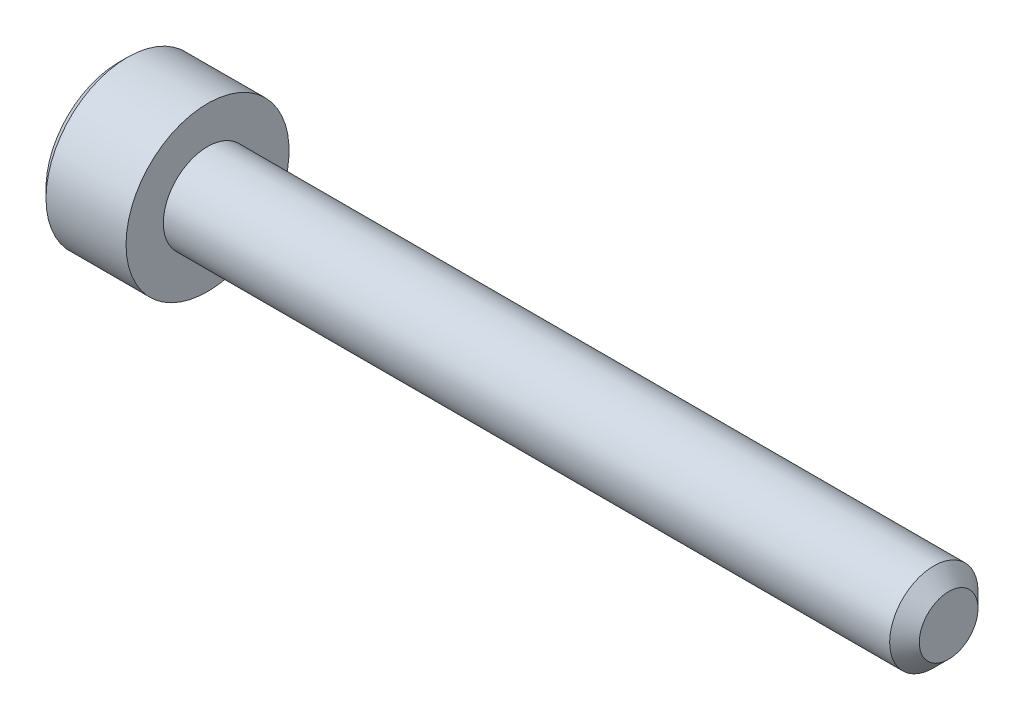
ISO-10303-21;
HEADER;
FILE_DESCRIPTION(('STEP AP214'),'2;1');
FILE_NAME('part.step','',(''),(''),'','','');
FILE_SCHEMA(('AUTOMOTIVE_DESIGN { 1 0 10303 214 1 1 1 1 }'));
ENDSEC;
DATA;
#1=APPLICATION_CONTEXT('core data for automotive mechanical design processes');
#2=APPLICATION_PROTOCOL_DEFINITION('international standard','automotive_design',2000,#1);
#3=PRODUCT_CONTEXT('',#1,'mechanical');
#4=PRODUCT('Part','Part','',(#3));
#5=PRODUCT_RELATED_PRODUCT_CATEGORY('part','',(#4));
#6=PRODUCT_DEFINITION_FORMATION('','',#4);
#7=PRODUCT_DEFINITION_CONTEXT('part definition',#1,'design');
#8=PRODUCT_DEFINITION('design','',#6,#7);
#9=PRODUCT_DEFINITION_SHAPE('','',#8);
#10=(LENGTH_UNIT() NAMED_UNIT(*) SI_UNIT(.MILLI.,.METRE.));
#11=(NAMED_UNIT(*) PLANE_ANGLE_UNIT() SI_UNIT($,.RADIAN.));
#12=(NAMED_UNIT(*) SI_UNIT($,.STERADIAN.) SOLID_ANGLE_UNIT());
#13=UNCERTAINTY_MEASURE_WITH_UNIT(LENGTH_MEASURE(1.E-05),#10,'distance_accuracy_value','');
#14=(GEOMETRIC_REPRESENTATION_CONTEXT(3) GLOBAL_UNCERTAINTY_ASSIGNED_CONTEXT((#13)) GLOBAL_UNIT_ASSIGNED_CONTEXT((#10,
#11,#12)) REPRESENTATION_CONTEXT('',''));
#15=CARTESIAN_POINT('',(0.,0.,0.));
#16=DIRECTION('',(0.,0.,1.));
#17=DIRECTION('',(1.,0.,0.));
#18=AXIS2_PLACEMENT_3D('',#15,#16,#17);
#19=CARTESIAN_POINT('',(0.,0.,0.));
#20=DIRECTION('',(1.,0.,0.));
#21=DIRECTION('',(0.,0.,-1.));
#22=AXIS2_PLACEMENT_3D('',#19,#20,#21);
#23=PLANE('',#22);
#24=DIRECTION('',(0.,0.866025403784439,0.5));
#25=VECTOR('',#24,1.);
#26=CARTESIAN_POINT('',(0.,1.4,-0.981495457622365));
#27=LINE('',#26,#25);
#28=CARTESIAN_POINT('',(0.,0.,-1.78978583448784));
#29=VERTEX_POINT('',#28);
#30=CARTESIAN_POINT('',(0.,1.55,-0.89489291724392));
#31=VERTEX_POINT('',#30);
#32=EDGE_CURVE('E171',#29,#31,#27,.T.);
#33=ORIENTED_EDGE('',*,*,#32,.T.);
#34=DIRECTION('',(0.,0.,1.));
#35=VECTOR('',#34,1.);
#36=CARTESIAN_POINT('',(0.,1.55,0.721687836487032));
#37=LINE('',#36,#35);
#38=CARTESIAN_POINT('',(0.,1.55,0.894892917243921));
#39=VERTEX_POINT('',#38);
#40=EDGE_CURVE('E186',#31,#39,#37,.T.);
#41=ORIENTED_EDGE('',*,*,#40,.T.);
#42=DIRECTION('',(0.,-0.866025403784439,0.5));
#43=VECTOR('',#42,1.);
#44=CARTESIAN_POINT('',(0.,0.150000000000001,1.7031832941094));
#45=LINE('',#44,#43);
#46=CARTESIAN_POINT('',(0.,0.,1.78978583448784));
#47=VERTEX_POINT('',#46);
#48=EDGE_CURVE('E183',#39,#47,#45,.T.);
#49=ORIENTED_EDGE('',*,*,#48,.T.);
#50=DIRECTION('',(0.,-0.866025403784439,-0.5));
#51=VECTOR('',#50,1.);
#52=CARTESIAN_POINT('',(0.,-1.4,0.981495457622367));
#53=LINE('',#52,#51);
#54=CARTESIAN_POINT('',(0.,-1.55,0.894892917243922));
#55=VERTEX_POINT('',#54);
#56=EDGE_CURVE('E180',#47,#55,#53,.T.);
#57=ORIENTED_EDGE('',*,*,#56,.T.);
#58=DIRECTION('',(0.,0.,-1.));
#59=VECTOR('',#58,1.);
#60=CARTESIAN_POINT('',(0.,-1.55,-0.721687836487031));
#61=LINE('',#60,#59);
#62=CARTESIAN_POINT('',(0.,-1.55,-0.894892917243921));
#63=VERTEX_POINT('',#62);
#64=EDGE_CURVE('E177',#55,#63,#61,.T.);
#65=ORIENTED_EDGE('',*,*,#64,.T.);
#66=DIRECTION('',(0.,0.866025403784439,-0.5));
#67=VECTOR('',#66,1.);
#68=CARTESIAN_POINT('',(0.,-0.150000000000001,-1.7031832941094));
#69=LINE('',#68,#67);
#70=EDGE_CURVE('E174',#63,#29,#69,.T.);
#71=ORIENTED_EDGE('',*,*,#70,.T.);
#72=EDGE_LOOP('',(#33,#41,#49,#57,#65,#71));
#73=FACE_BOUND('',#72,.T.);
#74=CARTESIAN_POINT('',(0.,0.,0.));
#75=DIRECTION('',(1.,0.,0.));
#76=DIRECTION('',(0.,0.,-1.));
#77=AXIS2_PLACEMENT_3D('',#74,#75,#76);
#78=CIRCLE('',#77,2.45);
#79=CARTESIAN_POINT('',(0.,0.,-2.45));
#80=VERTEX_POINT('',#79);
#81=EDGE_CURVE('E163',#80,#80,#78,.F.);
#82=ORIENTED_EDGE('',*,*,#81,.T.);
#83=EDGE_LOOP('',(#82));
#84=FACE_BOUND('',#83,.T.);
#85=ADVANCED_FACE('F39',(#73,#84),#23,.F.);
#86=CARTESIAN_POINT('',(28.,0.,0.));
#87=DIRECTION('',(-1.,0.,0.));
#88=DIRECTION('',(0.,0.,1.));
#89=AXIS2_PLACEMENT_3D('',#86,#87,#88);
#90=PLANE('',#89);
#91=CARTESIAN_POINT('',(28.,0.,0.));
#92=DIRECTION('',(-1.,0.,0.));
#93=DIRECTION('',(0.,0.,1.));
#94=AXIS2_PLACEMENT_3D('',#91,#92,#93);
#95=CIRCLE('',#94,0.989999999999994);
#96=CARTESIAN_POINT('',(28.,0.,0.989999999999994));
#97=VERTEX_POINT('',#96);
#98=EDGE_CURVE('E159',#97,#97,#95,.F.);
#99=ORIENTED_EDGE('',*,*,#98,.T.);
#100=EDGE_LOOP('',(#99));
#101=FACE_BOUND('',#100,.T.);
#102=ADVANCED_FACE('F286',(#101),#90,.F.);
#103=CARTESIAN_POINT('',(-88.7054908485857,0.,0.));
#104=DIRECTION('',(-1.,0.,0.));
#105=DIRECTION('',(0.,0.,1.));
#106=AXIS2_PLACEMENT_3D('',#103,#104,#105);
#107=CYLINDRICAL_SURFACE('',#106,1.49);
#108=CARTESIAN_POINT('',(27.5,0.,0.));
#109=DIRECTION('',(-1.,0.,0.));
#110=DIRECTION('',(0.,0.,1.));
#111=AXIS2_PLACEMENT_3D('',#108,#109,#110);
#112=CIRCLE('',#111,1.49);
#113=CARTESIAN_POINT('',(27.5,0.,1.49));
#114=VERTEX_POINT('',#113);
#115=EDGE_CURVE('E155',#114,#114,#112,.T.);
#116=ORIENTED_EDGE('',*,*,#115,.T.);
#117=EDGE_LOOP('',(#116));
#118=FACE_BOUND('',#117,.T.);
#119=CARTESIAN_POINT('',(3.,0.,0.));
#120=DIRECTION('',(-1.,0.,0.));
#121=DIRECTION('',(0.,0.,1.));
#122=AXIS2_PLACEMENT_3D('',#119,#120,#121);
#123=CIRCLE('',#122,1.49);
#124=CARTESIAN_POINT('',(3.,0.,1.49));
#125=VERTEX_POINT('',#124);
#126=EDGE_CURVE('E146',#125,#125,#123,.T.);
#127=ORIENTED_EDGE('',*,*,#126,.F.);
#128=EDGE_LOOP('',(#127));
#129=FACE_BOUND('',#128,.T.);
#130=ADVANCED_FACE('F291',(#118,#129),#107,.T.);
#131=CARTESIAN_POINT('',(3.,1.49,0.));
#132=DIRECTION('',(-1.,0.,0.));
#133=DIRECTION('',(0.,0.,1.));
#134=AXIS2_PLACEMENT_3D('',#131,#132,#133);
#135=PLANE('',#134);
#136=CARTESIAN_POINT('',(3.,0.,0.));
#137=DIRECTION('',(-1.,0.,0.));
#138=DIRECTION('',(0.,0.,1.));
#139=AXIS2_PLACEMENT_3D('',#136,#137,#138);
#140=CIRCLE('',#139,2.75);
#141=CARTESIAN_POINT('',(3.,0.,2.75));
#142=VERTEX_POINT('',#141);
#143=EDGE_CURVE('E140',#142,#142,#140,.T.);
#144=ORIENTED_EDGE('',*,*,#143,.F.);
#145=EDGE_LOOP('',(#144));
#146=FACE_BOUND('',#145,.T.);
#147=ORIENTED_EDGE('',*,*,#126,.T.);
#148=EDGE_LOOP('',(#147));
#149=FACE_BOUND('',#148,.T.);
#150=ADVANCED_FACE('F301',(#146,#149),#135,.F.);
#151=CARTESIAN_POINT('',(-88.7054908485857,0.,0.));
#152=DIRECTION('',(-1.,0.,0.));
#153=DIRECTION('',(0.,0.,1.));
#154=AXIS2_PLACEMENT_3D('',#151,#152,#153);
#155=CYLINDRICAL_SURFACE('',#154,2.75);
#156=CARTESIAN_POINT('',(0.299999999999995,0.,0.));
#157=DIRECTION('',(1.,0.,0.));
#158=DIRECTION('',(0.,0.,-1.));
#159=AXIS2_PLACEMENT_3D('',#156,#157,#158);
#160=CIRCLE('',#159,2.75);
#161=CARTESIAN_POINT('',(0.299999999999995,0.,-2.75));
#162=VERTEX_POINT('',#161);
#163=EDGE_CURVE('E167',#162,#162,#160,.T.);
#164=ORIENTED_EDGE('',*,*,#163,.T.);
#165=EDGE_LOOP('',(#164));
#166=FACE_BOUND('',#165,.T.);
#167=ORIENTED_EDGE('',*,*,#143,.T.);
#168=EDGE_LOOP('',(#167));
#169=FACE_BOUND('',#168,.T.);
#170=ADVANCED_FACE('F297',(#166,#169),#155,.T.);
#171=CARTESIAN_POINT('',(27.5,0.,0.));
#172=DIRECTION('',(-1.,0.,0.));
#173=DIRECTION('',(0.,0.,1.));
#174=AXIS2_PLACEMENT_3D('',#171,#172,#173);
#175=CONICAL_SURFACE('',#174,1.49,0.785398163397449);
#176=ORIENTED_EDGE('',*,*,#98,.F.);
#177=EDGE_LOOP('',(#176));
#178=FACE_BOUND('',#177,.T.);
#179=ORIENTED_EDGE('',*,*,#115,.F.);
#180=EDGE_LOOP('',(#179));
#181=FACE_BOUND('',#180,.T.);
#182=ADVANCED_FACE('F300',(#178,#181),#175,.T.);
#183=CARTESIAN_POINT('',(0.,0.,0.));
#184=DIRECTION('',(1.,0.,0.));
#185=DIRECTION('',(0.,0.,-1.));
#186=AXIS2_PLACEMENT_3D('',#183,#184,#185);
#187=CONICAL_SURFACE('',#186,2.45,0.78539816339745);
#188=ORIENTED_EDGE('',*,*,#163,.F.);
#189=EDGE_LOOP('',(#188));
#190=FACE_BOUND('',#189,.T.);
#191=ORIENTED_EDGE('',*,*,#81,.F.);
#192=EDGE_LOOP('',(#191));
#193=FACE_BOUND('',#192,.T.);
#194=ADVANCED_FACE('F311',(#190,#193),#187,.T.);
#195=CARTESIAN_POINT('',(2.5,1.25,0.721687836487032));
#196=DIRECTION('',(0.,-0.5,-0.866025403784438));
#197=DIRECTION('',(0.,0.866025403784439,-0.5));
#198=AXIS2_PLACEMENT_3D('',#195,#196,#197);
#199=PLANE('',#198);
#200=DIRECTION('',(-1.,0.,0.));
#201=VECTOR('',#200,1.);
#202=CARTESIAN_POINT('',(2.5,0.,1.44337567297407));
#203=LINE('',#202,#201);
#204=CARTESIAN_POINT('',(2.5,0.,1.44337567297407));
#205=VERTEX_POINT('',#204);
#206=CARTESIAN_POINT('',(0.300000000000002,0.,1.44337567297407));
#207=VERTEX_POINT('',#206);
#208=EDGE_CURVE('E130',#205,#207,#203,.T.);
#209=ORIENTED_EDGE('',*,*,#208,.T.);
#210=DIRECTION('',(0.,0.866025403784439,-0.5));
#211=VECTOR('',#210,1.);
#212=CARTESIAN_POINT('',(0.300000000000002,1.25,0.721687836487032));
#213=LINE('',#212,#211);
#214=CARTESIAN_POINT('',(0.300000000000002,1.25,0.721687836487032));
#215=VERTEX_POINT('',#214);
#216=EDGE_CURVE('E194',#207,#215,#213,.T.);
#217=ORIENTED_EDGE('',*,*,#216,.T.);
#218=DIRECTION('',(-1.,0.,0.));
#219=VECTOR('',#218,1.);
#220=CARTESIAN_POINT('',(2.5,1.25,0.721687836487032));
#221=LINE('',#220,#219);
#222=CARTESIAN_POINT('',(2.5,1.25,0.721687836487032));
#223=VERTEX_POINT('',#222);
#224=EDGE_CURVE('E133',#223,#215,#221,.T.);
#225=ORIENTED_EDGE('',*,*,#224,.F.);
#226=DIRECTION('',(0.,-0.866025403784439,0.5));
#227=VECTOR('',#226,1.);
#228=CARTESIAN_POINT('',(2.5,1.25,0.721687836487032));
#229=LINE('',#228,#227);
#230=EDGE_CURVE('E117',#223,#205,#229,.T.);
#231=ORIENTED_EDGE('',*,*,#230,.T.);
#232=EDGE_LOOP('',(#209,#217,#225,#231));
#233=FACE_BOUND('',#232,.T.);
#234=ADVANCED_FACE('F129',(#233),#199,.T.);
#235=CARTESIAN_POINT('',(2.5,0.,1.44337567297407));
#236=DIRECTION('',(0.,0.5,-0.866025403784438));
#237=DIRECTION('',(0.,0.866025403784439,0.5));
#238=AXIS2_PLACEMENT_3D('',#235,#236,#237);
#239=PLANE('',#238);
#240=DIRECTION('',(-1.,0.,0.));
#241=VECTOR('',#240,1.);
#242=CARTESIAN_POINT('',(2.5,-1.25,0.721687836487033));
#243=LINE('',#242,#241);
#244=CARTESIAN_POINT('',(2.5,-1.25,0.721687836487033));
#245=VERTEX_POINT('',#244);
#246=CARTESIAN_POINT('',(0.300000000000002,-1.25,0.721687836487033));
#247=VERTEX_POINT('',#246);
#248=EDGE_CURVE('E141',#245,#247,#243,.T.);
#249=ORIENTED_EDGE('',*,*,#248,.T.);
#250=DIRECTION('',(0.,0.866025403784439,0.5));
#251=VECTOR('',#250,1.);
#252=CARTESIAN_POINT('',(0.300000000000002,0.,1.44337567297407));
#253=LINE('',#252,#251);
#254=EDGE_CURVE('E138',#247,#207,#253,.T.);
#255=ORIENTED_EDGE('',*,*,#254,.T.);
#256=ORIENTED_EDGE('',*,*,#208,.F.);
#257=DIRECTION('',(0.,-0.866025403784439,-0.5));
#258=VECTOR('',#257,1.);
#259=CARTESIAN_POINT('',(2.5,0.,1.44337567297407));
#260=LINE('',#259,#258);
#261=EDGE_CURVE('E113',#205,#245,#260,.T.);
#262=ORIENTED_EDGE('',*,*,#261,.T.);
#263=EDGE_LOOP('',(#249,#255,#256,#262));
#264=FACE_BOUND('',#263,.T.);
#265=ADVANCED_FACE('F136',(#264),#239,.T.);
#266=CARTESIAN_POINT('',(2.5,-1.25,0.721687836487033));
#267=DIRECTION('',(0.,1.,0.));
#268=DIRECTION('',(0.,0.,1.));
#269=AXIS2_PLACEMENT_3D('',#266,#267,#268);
#270=PLANE('',#269);
#271=DIRECTION('',(-1.,0.,0.));
#272=VECTOR('',#271,1.);
#273=CARTESIAN_POINT('',(2.5,-1.25,-0.721687836487031));
#274=LINE('',#273,#272);
#275=CARTESIAN_POINT('',(2.5,-1.25,-0.721687836487031));
#276=VERTEX_POINT('',#275);
#277=CARTESIAN_POINT('',(0.300000000000002,-1.25,-0.721687836487031));
#278=VERTEX_POINT('',#277);
#279=EDGE_CURVE('E148',#276,#278,#274,.T.);
#280=ORIENTED_EDGE('',*,*,#279,.T.);
#281=DIRECTION('',(0.,0.,1.));
#282=VECTOR('',#281,1.);
#283=CARTESIAN_POINT('',(0.300000000000002,-1.25,0.721687836487033));
#284=LINE('',#283,#282);
#285=EDGE_CURVE('E199',#278,#247,#284,.T.);
#286=ORIENTED_EDGE('',*,*,#285,.T.);
#287=ORIENTED_EDGE('',*,*,#248,.F.);
#288=DIRECTION('',(0.,0.,-1.));
#289=VECTOR('',#288,1.);
#290=CARTESIAN_POINT('',(2.5,-1.25,0.721687836487033));
#291=LINE('',#290,#289);
#292=EDGE_CURVE('E119',#245,#276,#291,.T.);
#293=ORIENTED_EDGE('',*,*,#292,.T.);
#294=EDGE_LOOP('',(#280,#286,#287,#293));
#295=FACE_BOUND('',#294,.T.);
#296=ADVANCED_FACE('F234',(#295),#270,.T.);
#297=CARTESIAN_POINT('',(2.5,-1.25,-0.721687836487031));
#298=DIRECTION('',(0.,0.5,0.866025403784439));
#299=DIRECTION('',(0.,-0.866025403784439,0.5));
#300=AXIS2_PLACEMENT_3D('',#297,#298,#299);
#301=PLANE('',#300);
#302=DIRECTION('',(-1.,0.,0.));
#303=VECTOR('',#302,1.);
#304=CARTESIAN_POINT('',(2.5,0.,-1.44337567297406));
#305=LINE('',#304,#303);
#306=CARTESIAN_POINT('',(2.5,0.,-1.44337567297406));
#307=VERTEX_POINT('',#306);
#308=CARTESIAN_POINT('',(0.300000000000002,0.,-1.44337567297406));
#309=VERTEX_POINT('',#308);
#310=EDGE_CURVE('E236',#307,#309,#305,.T.);
#311=ORIENTED_EDGE('',*,*,#310,.T.);
#312=DIRECTION('',(0.,-0.866025403784439,0.5));
#313=VECTOR('',#312,1.);
#314=CARTESIAN_POINT('',(0.300000000000002,-1.25,-0.721687836487031));
#315=LINE('',#314,#313);
#316=EDGE_CURVE('E49',#309,#278,#315,.T.);
#317=ORIENTED_EDGE('',*,*,#316,.T.);
#318=ORIENTED_EDGE('',*,*,#279,.F.);
#319=DIRECTION('',(0.,0.866025403784439,-0.499999999999999));
#320=VECTOR('',#319,1.);
#321=CARTESIAN_POINT('',(2.5,-1.25,-0.721687836487031));
#322=LINE('',#321,#320);
#323=EDGE_CURVE('E251',#276,#307,#322,.T.);
#324=ORIENTED_EDGE('',*,*,#323,.T.);
#325=EDGE_LOOP('',(#311,#317,#318,#324));
#326=FACE_BOUND('',#325,.T.);
#327=ADVANCED_FACE('F255',(#326),#301,.T.);
#328=CARTESIAN_POINT('',(2.5,0.,-1.44337567297406));
#329=DIRECTION('',(0.,-0.5,0.866025403784439));
#330=DIRECTION('',(0.,-0.866025403784439,-0.5));
#331=AXIS2_PLACEMENT_3D('',#328,#329,#330);
#332=PLANE('',#331);
#333=DIRECTION('',(-1.,0.,0.));
#334=VECTOR('',#333,1.);
#335=CARTESIAN_POINT('',(2.5,1.25,-0.72168783648703));
#336=LINE('',#335,#334);
#337=CARTESIAN_POINT('',(2.5,1.25,-0.72168783648703));
#338=VERTEX_POINT('',#337);
#339=CARTESIAN_POINT('',(0.300000000000002,1.25,-0.72168783648703));
#340=VERTEX_POINT('',#339);
#341=EDGE_CURVE('E238',#338,#340,#336,.T.);
#342=ORIENTED_EDGE('',*,*,#341,.T.);
#343=DIRECTION('',(0.,-0.866025403784439,-0.5));
#344=VECTOR('',#343,1.);
#345=CARTESIAN_POINT('',(0.300000000000002,0.,-1.44337567297406));
#346=LINE('',#345,#344);
#347=EDGE_CURVE('E11',#340,#309,#346,.T.);
#348=ORIENTED_EDGE('',*,*,#347,.T.);
#349=ORIENTED_EDGE('',*,*,#310,.F.);
#350=DIRECTION('',(0.,0.866025403784438,0.5));
#351=VECTOR('',#350,1.);
#352=CARTESIAN_POINT('',(2.5,0.,-1.44337567297406));
#353=LINE('',#352,#351);
#354=EDGE_CURVE('E248',#307,#338,#353,.T.);
#355=ORIENTED_EDGE('',*,*,#354,.T.);
#356=EDGE_LOOP('',(#342,#348,#349,#355));
#357=FACE_BOUND('',#356,.T.);
#358=ADVANCED_FACE('F257',(#357),#332,.T.);
#359=CARTESIAN_POINT('',(2.5,1.25,-0.72168783648703));
#360=DIRECTION('',(0.,-1.,0.));
#361=DIRECTION('',(0.,0.,-1.));
#362=AXIS2_PLACEMENT_3D('',#359,#360,#361);
#363=PLANE('',#362);
#364=ORIENTED_EDGE('',*,*,#224,.T.);
#365=DIRECTION('',(0.,0.,-1.));
#366=VECTOR('',#365,1.);
#367=CARTESIAN_POINT('',(0.300000000000002,1.25,-0.72168783648703));
#368=LINE('',#367,#366);
#369=EDGE_CURVE('E190',#215,#340,#368,.T.);
#370=ORIENTED_EDGE('',*,*,#369,.T.);
#371=ORIENTED_EDGE('',*,*,#341,.F.);
#372=DIRECTION('',(0.,0.,1.));
#373=VECTOR('',#372,1.);
#374=CARTESIAN_POINT('',(2.5,1.25,-0.72168783648703));
#375=LINE('',#374,#373);
#376=EDGE_CURVE('E245',#338,#223,#375,.T.);
#377=ORIENTED_EDGE('',*,*,#376,.T.);
#378=EDGE_LOOP('',(#364,#370,#371,#377));
#379=FACE_BOUND('',#378,.T.);
#380=ADVANCED_FACE('F260',(#379),#363,.T.);
#381=CARTESIAN_POINT('',(2.5,0.,0.));
#382=DIRECTION('',(1.,0.,0.));
#383=DIRECTION('',(0.,0.,-1.));
#384=AXIS2_PLACEMENT_3D('',#381,#382,#383);
#385=PLANE('',#384);
#386=ORIENTED_EDGE('',*,*,#230,.F.);
#387=ORIENTED_EDGE('',*,*,#376,.F.);
#388=ORIENTED_EDGE('',*,*,#354,.F.);
#389=ORIENTED_EDGE('',*,*,#323,.F.);
#390=ORIENTED_EDGE('',*,*,#292,.F.);
#391=ORIENTED_EDGE('',*,*,#261,.F.);
#392=EDGE_LOOP('',(#386,#387,#388,#389,#390,#391));
#393=FACE_BOUND('',#392,.T.);
#394=ADVANCED_FACE('F115',(#393),#385,.F.);
#395=CARTESIAN_POINT('',(0.,-1.55,0.));
#396=DIRECTION('',(-0.70710678118655,0.707106781186545,0.));
#397=DIRECTION('',(0.,0.,1.));
#398=AXIS2_PLACEMENT_3D('',#395,#396,#397);
#399=PLANE('',#398);
#400=DIRECTION('',(0.654653670707975,0.654653670707979,-0.377964473009228));
#401=VECTOR('',#400,1.);
#402=CARTESIAN_POINT('',(0.221428571428572,-1.32857142857143,0.767051071923361));
#403=LINE('',#402,#401);
#404=EDGE_CURVE('E217',#247,#55,#403,.F.);
#405=ORIENTED_EDGE('',*,*,#404,.F.);
#406=ORIENTED_EDGE('',*,*,#285,.F.);
#407=DIRECTION('',(0.654653670707975,0.654653670707979,0.377964473009228));
#408=VECTOR('',#407,1.);
#409=CARTESIAN_POINT('',(0.221428571428571,-1.32857142857143,-0.767051071923361));
#410=LINE('',#409,#408);
#411=EDGE_CURVE('E43',#63,#278,#410,.T.);
#412=ORIENTED_EDGE('',*,*,#411,.F.);
#413=ORIENTED_EDGE('',*,*,#64,.F.);
#414=EDGE_LOOP('',(#405,#406,#412,#413));
#415=FACE_BOUND('',#414,.T.);
#416=ADVANCED_FACE('F41',(#415),#399,.T.);
#417=CARTESIAN_POINT('',(0.,-0.775,-1.34233937586588));
#418=DIRECTION('',(-0.707106781186549,0.353553390593272,0.612372435695793));
#419=DIRECTION('',(0.,-0.866025403784439,0.5));
#420=AXIS2_PLACEMENT_3D('',#417,#418,#419);
#421=PLANE('',#420);
#422=ORIENTED_EDGE('',*,*,#411,.T.);
#423=ORIENTED_EDGE('',*,*,#316,.F.);
#424=DIRECTION('',(0.654653670707975,0.,0.755928946018456));
#425=VECTOR('',#424,1.);
#426=CARTESIAN_POINT('',(0.221428571428572,0.,-1.53410214384672));
#427=LINE('',#426,#425);
#428=EDGE_CURVE('E214',#29,#309,#427,.T.);
#429=ORIENTED_EDGE('',*,*,#428,.F.);
#430=ORIENTED_EDGE('',*,*,#70,.F.);
#431=EDGE_LOOP('',(#422,#423,#429,#430));
#432=FACE_BOUND('',#431,.T.);
#433=ADVANCED_FACE('F228',(#432),#421,.T.);
#434=CARTESIAN_POINT('',(0.,-0.775000000000002,1.34233937586588));
#435=DIRECTION('',(-0.707106781186549,0.353553390593273,-0.612372435695793));
#436=DIRECTION('',(0.,0.866025403784439,0.5));
#437=AXIS2_PLACEMENT_3D('',#434,#435,#436);
#438=PLANE('',#437);
#439=ORIENTED_EDGE('',*,*,#404,.T.);
#440=ORIENTED_EDGE('',*,*,#56,.F.);
#441=DIRECTION('',(0.654653670707975,0.,-0.755928946018456));
#442=VECTOR('',#441,1.);
#443=CARTESIAN_POINT('',(0.221428571428572,0.,1.53410214384672));
#444=LINE('',#443,#442);
#445=EDGE_CURVE('E210',#207,#47,#444,.F.);
#446=ORIENTED_EDGE('',*,*,#445,.F.);
#447=ORIENTED_EDGE('',*,*,#254,.F.);
#448=EDGE_LOOP('',(#439,#440,#446,#447));
#449=FACE_BOUND('',#448,.T.);
#450=ADVANCED_FACE('F277',(#449),#438,.T.);
#451=CARTESIAN_POINT('',(0.,0.775000000000001,-1.34233937586588));
#452=DIRECTION('',(-0.707106781186549,-0.353553390593273,0.612372435695793));
#453=DIRECTION('',(0.,-0.866025403784439,-0.5));
#454=AXIS2_PLACEMENT_3D('',#451,#452,#453);
#455=PLANE('',#454);
#456=ORIENTED_EDGE('',*,*,#428,.T.);
#457=ORIENTED_EDGE('',*,*,#347,.F.);
#458=DIRECTION('',(-0.654653670707975,0.654653670707979,-0.377964473009228));
#459=VECTOR('',#458,1.);
#460=CARTESIAN_POINT('',(0.221428571428571,1.32857142857143,-0.767051071923359));
#461=LINE('',#460,#459);
#462=EDGE_CURVE('E207',#31,#340,#461,.F.);
#463=ORIENTED_EDGE('',*,*,#462,.F.);
#464=ORIENTED_EDGE('',*,*,#32,.F.);
#465=EDGE_LOOP('',(#456,#457,#463,#464));
#466=FACE_BOUND('',#465,.T.);
#467=ADVANCED_FACE('F275',(#466),#455,.T.);
#468=CARTESIAN_POINT('',(0.,0.775000000000002,1.34233937586588));
#469=DIRECTION('',(-0.707106781186549,-0.353553390593273,-0.612372435695793));
#470=DIRECTION('',(0.,0.866025403784439,-0.5));
#471=AXIS2_PLACEMENT_3D('',#468,#469,#470);
#472=PLANE('',#471);
#473=ORIENTED_EDGE('',*,*,#445,.T.);
#474=ORIENTED_EDGE('',*,*,#48,.F.);
#475=DIRECTION('',(0.654653670707975,-0.654653670707979,-0.377964473009228));
#476=VECTOR('',#475,1.);
#477=CARTESIAN_POINT('',(0.221428571428571,1.32857142857143,0.767051071923361));
#478=LINE('',#477,#476);
#479=EDGE_CURVE('E204',#215,#39,#478,.F.);
#480=ORIENTED_EDGE('',*,*,#479,.F.);
#481=ORIENTED_EDGE('',*,*,#216,.F.);
#482=EDGE_LOOP('',(#473,#474,#480,#481));
#483=FACE_BOUND('',#482,.T.);
#484=ADVANCED_FACE('F270',(#483),#472,.T.);
#485=CARTESIAN_POINT('',(0.,1.55,0.));
#486=DIRECTION('',(-0.70710678118655,-0.707106781186545,0.));
#487=DIRECTION('',(0.,0.,-1.));
#488=AXIS2_PLACEMENT_3D('',#485,#486,#487);
#489=PLANE('',#488);
#490=ORIENTED_EDGE('',*,*,#462,.T.);
#491=ORIENTED_EDGE('',*,*,#369,.F.);
#492=ORIENTED_EDGE('',*,*,#479,.T.);
#493=ORIENTED_EDGE('',*,*,#40,.F.);
#494=EDGE_LOOP('',(#490,#491,#492,#493));
#495=FACE_BOUND('',#494,.T.);
#496=ADVANCED_FACE('F264',(#495),#489,.T.);
#497=CLOSED_SHELL('',(#85,#102,#130,#150,#170,#182,#194,#234,#265,#296,#327,#358,#380,#394,#416,
#433,#450,#467,#484,#496));
#498=MANIFOLD_SOLID_BREP('B2',#497);
#499=ADVANCED_BREP_SHAPE_REPRESENTATION('',(#18,#498),#14);
#500=SHAPE_DEFINITION_REPRESENTATION(#9,#499);
ENDSEC;
END-ISO-10303-21;
